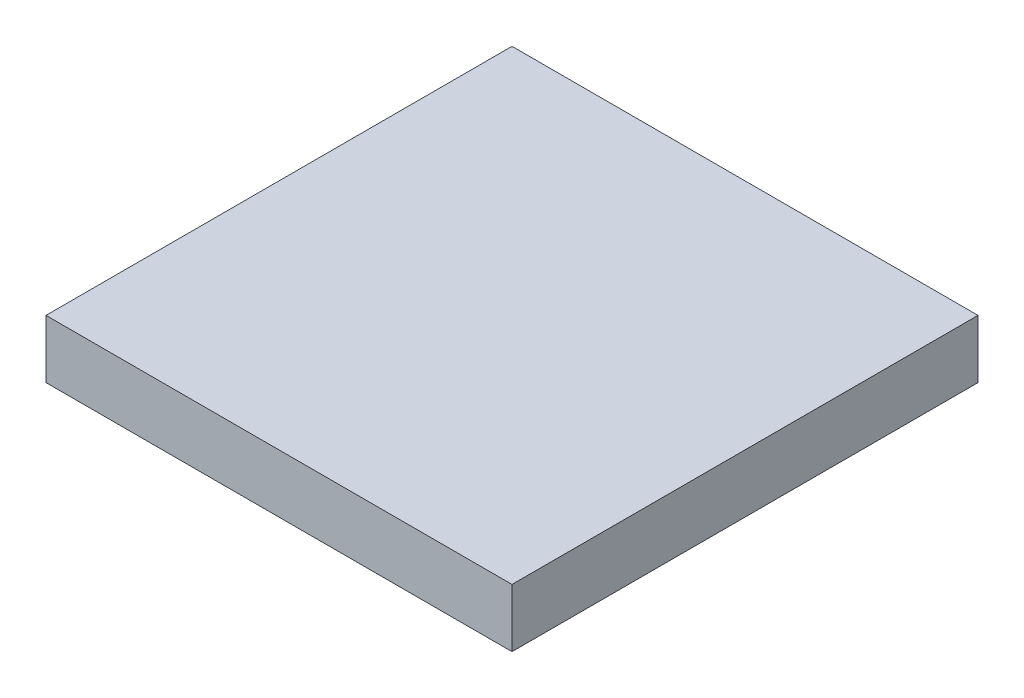
ISO-10303-21;
HEADER;
FILE_DESCRIPTION(('STEP AP214'),'2;1');
FILE_NAME('part.step','',(''),(''),'','','');
FILE_SCHEMA(('AUTOMOTIVE_DESIGN { 1 0 10303 214 1 1 1 1 }'));
ENDSEC;
DATA;
#1=APPLICATION_CONTEXT('core data for automotive mechanical design processes');
#2=APPLICATION_PROTOCOL_DEFINITION('international standard','automotive_design',2000,#1);
#3=PRODUCT_CONTEXT('',#1,'mechanical');
#4=PRODUCT('Part','Part','',(#3));
#5=PRODUCT_RELATED_PRODUCT_CATEGORY('part','',(#4));
#6=PRODUCT_DEFINITION_FORMATION('','',#4);
#7=PRODUCT_DEFINITION_CONTEXT('part definition',#1,'design');
#8=PRODUCT_DEFINITION('design','',#6,#7);
#9=PRODUCT_DEFINITION_SHAPE('','',#8);
#10=(LENGTH_UNIT() NAMED_UNIT(*) SI_UNIT(.MILLI.,.METRE.));
#11=(NAMED_UNIT(*) PLANE_ANGLE_UNIT() SI_UNIT($,.RADIAN.));
#12=(NAMED_UNIT(*) SI_UNIT($,.STERADIAN.) SOLID_ANGLE_UNIT());
#13=UNCERTAINTY_MEASURE_WITH_UNIT(LENGTH_MEASURE(1.E-05),#10,'distance_accuracy_value','');
#14=(GEOMETRIC_REPRESENTATION_CONTEXT(3) GLOBAL_UNCERTAINTY_ASSIGNED_CONTEXT((#13)) GLOBAL_UNIT_ASSIGNED_CONTEXT((#10,
#11,#12)) REPRESENTATION_CONTEXT('',''));
#15=CARTESIAN_POINT('',(0.,0.,0.));
#16=DIRECTION('',(0.,0.,1.));
#17=DIRECTION('',(1.,0.,0.));
#18=AXIS2_PLACEMENT_3D('',#15,#16,#17);
#19=CARTESIAN_POINT('',(12.7,3.175,12.7));
#20=DIRECTION('',(-1.,0.,0.));
#21=DIRECTION('',(0.,0.,1.));
#22=AXIS2_PLACEMENT_3D('',#19,#20,#21);
#23=PLANE('',#22);
#24=DIRECTION('',(0.,0.,-1.));
#25=VECTOR('',#24,1.);
#26=CARTESIAN_POINT('',(12.7,0.,12.7));
#27=LINE('',#26,#25);
#28=CARTESIAN_POINT('',(12.7,0.,12.7));
#29=VERTEX_POINT('',#28);
#30=CARTESIAN_POINT('',(12.7,0.,-12.7));
#31=VERTEX_POINT('',#30);
#32=EDGE_CURVE('E107',#29,#31,#27,.T.);
#33=ORIENTED_EDGE('',*,*,#32,.T.);
#34=DIRECTION('',(0.,-1.,0.));
#35=VECTOR('',#34,1.);
#36=CARTESIAN_POINT('',(12.7,3.175,-12.7));
#37=LINE('',#36,#35);
#38=CARTESIAN_POINT('',(12.7,3.175,-12.7));
#39=VERTEX_POINT('',#38);
#40=EDGE_CURVE('E11',#39,#31,#37,.T.);
#41=ORIENTED_EDGE('',*,*,#40,.F.);
#42=DIRECTION('',(0.,0.,-1.));
#43=VECTOR('',#42,1.);
#44=CARTESIAN_POINT('',(12.7,3.175,12.7));
#45=LINE('',#44,#43);
#46=CARTESIAN_POINT('',(12.7,3.175,12.7));
#47=VERTEX_POINT('',#46);
#48=EDGE_CURVE('E91',#47,#39,#45,.T.);
#49=ORIENTED_EDGE('',*,*,#48,.F.);
#50=DIRECTION('',(0.,-1.,0.));
#51=VECTOR('',#50,1.);
#52=CARTESIAN_POINT('',(12.7,3.175,12.7));
#53=LINE('',#52,#51);
#54=EDGE_CURVE('E103',#47,#29,#53,.T.);
#55=ORIENTED_EDGE('',*,*,#54,.T.);
#56=EDGE_LOOP('',(#33,#41,#49,#55));
#57=FACE_BOUND('',#56,.T.);
#58=ADVANCED_FACE('F39',(#57),#23,.F.);
#59=CARTESIAN_POINT('',(-12.7,3.175,-12.7));
#60=DIRECTION('',(0.,0.,1.));
#61=DIRECTION('',(1.,0.,0.));
#62=AXIS2_PLACEMENT_3D('',#59,#60,#61);
#63=PLANE('',#62);
#64=DIRECTION('',(-1.,0.,0.));
#65=VECTOR('',#64,1.);
#66=CARTESIAN_POINT('',(-12.7,0.,-12.7));
#67=LINE('',#66,#65);
#68=CARTESIAN_POINT('',(-12.7,0.,-12.7));
#69=VERTEX_POINT('',#68);
#70=EDGE_CURVE('E96',#31,#69,#67,.T.);
#71=ORIENTED_EDGE('',*,*,#70,.T.);
#72=DIRECTION('',(0.,-1.,0.));
#73=VECTOR('',#72,1.);
#74=CARTESIAN_POINT('',(-12.7,3.175,-12.7));
#75=LINE('',#74,#73);
#76=CARTESIAN_POINT('',(-12.7,3.175,-12.7));
#77=VERTEX_POINT('',#76);
#78=EDGE_CURVE('E48',#77,#69,#75,.T.);
#79=ORIENTED_EDGE('',*,*,#78,.F.);
#80=DIRECTION('',(-1.,0.,0.));
#81=VECTOR('',#80,1.);
#82=CARTESIAN_POINT('',(-12.7,3.175,-12.7));
#83=LINE('',#82,#81);
#84=EDGE_CURVE('E86',#39,#77,#83,.T.);
#85=ORIENTED_EDGE('',*,*,#84,.F.);
#86=ORIENTED_EDGE('',*,*,#40,.T.);
#87=EDGE_LOOP('',(#71,#79,#85,#86));
#88=FACE_BOUND('',#87,.T.);
#89=ADVANCED_FACE('F95',(#88),#63,.F.);
#90=CARTESIAN_POINT('',(-12.7,3.175,12.7));
#91=DIRECTION('',(1.,0.,0.));
#92=DIRECTION('',(0.,0.,-1.));
#93=AXIS2_PLACEMENT_3D('',#90,#91,#92);
#94=PLANE('',#93);
#95=DIRECTION('',(0.,0.,1.));
#96=VECTOR('',#95,1.);
#97=CARTESIAN_POINT('',(-12.7,0.,12.7));
#98=LINE('',#97,#96);
#99=CARTESIAN_POINT('',(-12.7,0.,12.7));
#100=VERTEX_POINT('',#99);
#101=EDGE_CURVE('E73',#69,#100,#98,.T.);
#102=ORIENTED_EDGE('',*,*,#101,.T.);
#103=DIRECTION('',(0.,-1.,0.));
#104=VECTOR('',#103,1.);
#105=CARTESIAN_POINT('',(-12.7,3.175,12.7));
#106=LINE('',#105,#104);
#107=CARTESIAN_POINT('',(-12.7,3.175,12.7));
#108=VERTEX_POINT('',#107);
#109=EDGE_CURVE('E98',#108,#100,#106,.T.);
#110=ORIENTED_EDGE('',*,*,#109,.F.);
#111=DIRECTION('',(0.,0.,1.));
#112=VECTOR('',#111,1.);
#113=CARTESIAN_POINT('',(-12.7,3.175,12.7));
#114=LINE('',#113,#112);
#115=EDGE_CURVE('E89',#77,#108,#114,.T.);
#116=ORIENTED_EDGE('',*,*,#115,.F.);
#117=ORIENTED_EDGE('',*,*,#78,.T.);
#118=EDGE_LOOP('',(#102,#110,#116,#117));
#119=FACE_BOUND('',#118,.T.);
#120=ADVANCED_FACE('F99',(#119),#94,.F.);
#121=CARTESIAN_POINT('',(-12.7,3.175,12.7));
#122=DIRECTION('',(0.,0.,-1.));
#123=DIRECTION('',(-1.,0.,0.));
#124=AXIS2_PLACEMENT_3D('',#121,#122,#123);
#125=PLANE('',#124);
#126=DIRECTION('',(1.,0.,0.));
#127=VECTOR('',#126,1.);
#128=CARTESIAN_POINT('',(-12.7,0.,12.7));
#129=LINE('',#128,#127);
#130=EDGE_CURVE('E79',#100,#29,#129,.T.);
#131=ORIENTED_EDGE('',*,*,#130,.T.);
#132=ORIENTED_EDGE('',*,*,#54,.F.);
#133=DIRECTION('',(1.,0.,0.));
#134=VECTOR('',#133,1.);
#135=CARTESIAN_POINT('',(-12.7,3.175,12.7));
#136=LINE('',#135,#134);
#137=EDGE_CURVE('E56',#108,#47,#136,.T.);
#138=ORIENTED_EDGE('',*,*,#137,.F.);
#139=ORIENTED_EDGE('',*,*,#109,.T.);
#140=EDGE_LOOP('',(#131,#132,#138,#139));
#141=FACE_BOUND('',#140,.T.);
#142=ADVANCED_FACE('F120',(#141),#125,.F.);
#143=CARTESIAN_POINT('',(0.,3.175,0.));
#144=DIRECTION('',(0.,-1.,0.));
#145=DIRECTION('',(0.,0.,-1.));
#146=AXIS2_PLACEMENT_3D('',#143,#144,#145);
#147=PLANE('',#146);
#148=ORIENTED_EDGE('',*,*,#48,.T.);
#149=ORIENTED_EDGE('',*,*,#84,.T.);
#150=ORIENTED_EDGE('',*,*,#115,.T.);
#151=ORIENTED_EDGE('',*,*,#137,.T.);
#152=EDGE_LOOP('',(#148,#149,#150,#151));
#153=FACE_BOUND('',#152,.T.);
#154=ADVANCED_FACE('F87',(#153),#147,.F.);
#155=CARTESIAN_POINT('',(0.,0.,0.));
#156=DIRECTION('',(0.,-1.,0.));
#157=DIRECTION('',(0.,0.,-1.));
#158=AXIS2_PLACEMENT_3D('',#155,#156,#157);
#159=PLANE('',#158);
#160=ORIENTED_EDGE('',*,*,#32,.F.);
#161=ORIENTED_EDGE('',*,*,#130,.F.);
#162=ORIENTED_EDGE('',*,*,#101,.F.);
#163=ORIENTED_EDGE('',*,*,#70,.F.);
#164=EDGE_LOOP('',(#160,#161,#162,#163));
#165=FACE_BOUND('',#164,.T.);
#166=ADVANCED_FACE('F123',(#165),#159,.T.);
#167=CLOSED_SHELL('',(#58,#89,#120,#142,#154,#166));
#168=MANIFOLD_SOLID_BREP('B2',#167);
#169=ADVANCED_BREP_SHAPE_REPRESENTATION('',(#18,#168),#14);
#170=SHAPE_DEFINITION_REPRESENTATION(#9,#169);
ENDSEC;
END-ISO-10303-21;
